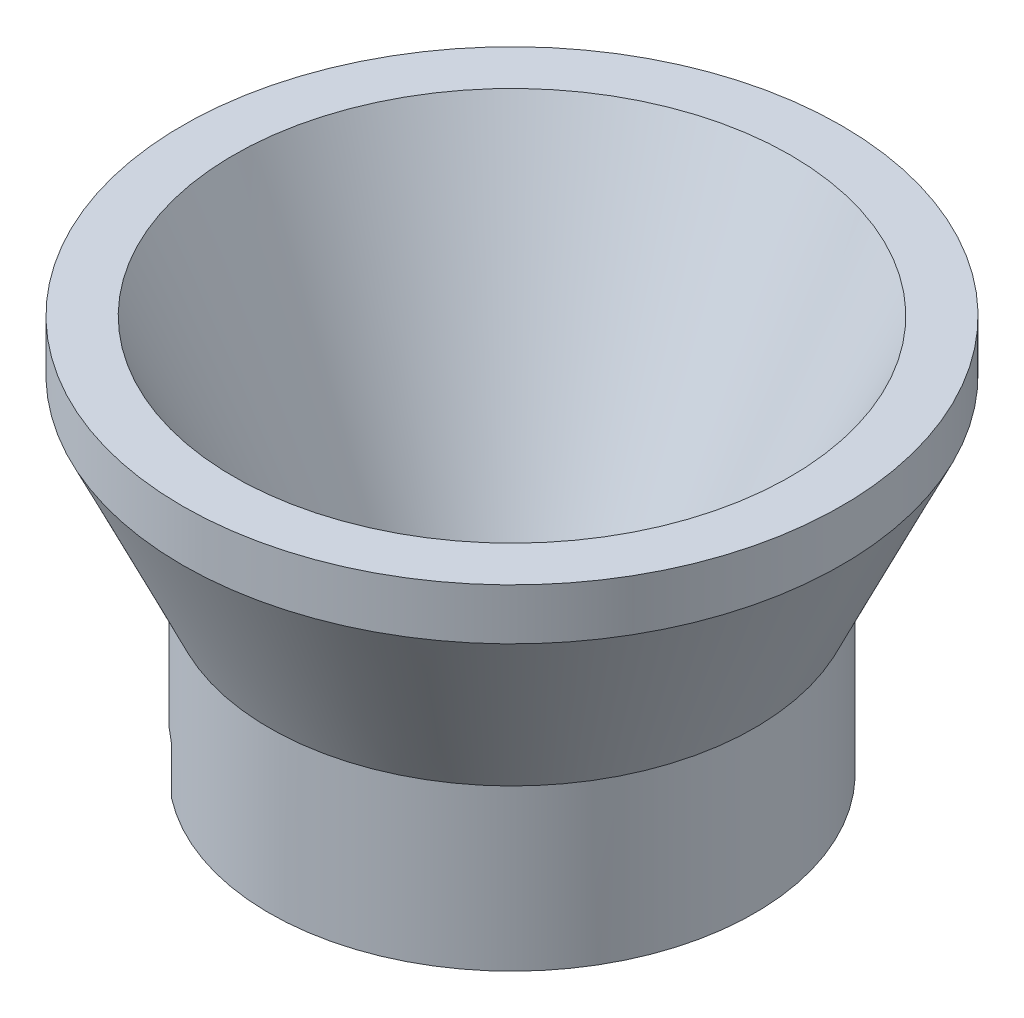
ISO-10303-21;
HEADER;
FILE_DESCRIPTION(('STEP AP214'),'2;1');
FILE_NAME('part.step','',(''),(''),'','','');
FILE_SCHEMA(('AUTOMOTIVE_DESIGN { 1 0 10303 214 1 1 1 1 }'));
ENDSEC;
DATA;
#1=APPLICATION_CONTEXT('core data for automotive mechanical design processes');
#2=APPLICATION_PROTOCOL_DEFINITION('international standard','automotive_design',2000,#1);
#3=PRODUCT_CONTEXT('',#1,'mechanical');
#4=PRODUCT('Part','Part','',(#3));
#5=PRODUCT_RELATED_PRODUCT_CATEGORY('part','',(#4));
#6=PRODUCT_DEFINITION_FORMATION('','',#4);
#7=PRODUCT_DEFINITION_CONTEXT('part definition',#1,'design');
#8=PRODUCT_DEFINITION('design','',#6,#7);
#9=PRODUCT_DEFINITION_SHAPE('','',#8);
#10=(LENGTH_UNIT() NAMED_UNIT(*) SI_UNIT(.MILLI.,.METRE.));
#11=(NAMED_UNIT(*) PLANE_ANGLE_UNIT() SI_UNIT($,.RADIAN.));
#12=(NAMED_UNIT(*) SI_UNIT($,.STERADIAN.) SOLID_ANGLE_UNIT());
#13=UNCERTAINTY_MEASURE_WITH_UNIT(LENGTH_MEASURE(1.E-05),#10,'distance_accuracy_value','');
#14=(GEOMETRIC_REPRESENTATION_CONTEXT(3) GLOBAL_UNCERTAINTY_ASSIGNED_CONTEXT((#13)) GLOBAL_UNIT_ASSIGNED_CONTEXT((#10,
#11,#12)) REPRESENTATION_CONTEXT('',''));
#15=CARTESIAN_POINT('',(0.,0.,0.));
#16=DIRECTION('',(0.,0.,1.));
#17=DIRECTION('',(1.,0.,0.));
#18=AXIS2_PLACEMENT_3D('',#15,#16,#17);
#19=CARTESIAN_POINT('',(0.,0.,0.));
#20=DIRECTION('',(0.,-1.,0.));
#21=DIRECTION('',(0.,0.,-1.));
#22=AXIS2_PLACEMENT_3D('',#19,#20,#21);
#23=CYLINDRICAL_SURFACE('',#22,7.5);
#24=DIRECTION('',(0.,1.,0.));
#25=VECTOR('',#24,1.);
#26=CARTESIAN_POINT('',(0.,0.,-7.5));
#27=LINE('',#26,#25);
#28=CARTESIAN_POINT('',(0.,0.,-7.5));
#29=VERTEX_POINT('',#28);
#30=CARTESIAN_POINT('',(0.,1.85000000000001,-7.5));
#31=VERTEX_POINT('',#30);
#32=EDGE_CURVE('E122',#29,#31,#27,.T.);
#33=ORIENTED_EDGE('',*,*,#32,.F.);
#34=CARTESIAN_POINT('',(0.,0.,0.));
#35=DIRECTION('',(0.,-1.,0.));
#36=DIRECTION('',(0.,0.,-1.));
#37=AXIS2_PLACEMENT_3D('',#34,#35,#36);
#38=CIRCLE('',#37,7.5);
#39=CARTESIAN_POINT('',(0.,0.,7.5));
#40=VERTEX_POINT('',#39);
#41=EDGE_CURVE('E11',#29,#40,#38,.T.);
#42=ORIENTED_EDGE('',*,*,#41,.T.);
#43=DIRECTION('',(0.,-1.,0.));
#44=VECTOR('',#43,1.);
#45=CARTESIAN_POINT('',(0.,0.,7.5));
#46=LINE('',#45,#44);
#47=CARTESIAN_POINT('',(0.,1.85000000000001,7.5));
#48=VERTEX_POINT('',#47);
#49=EDGE_CURVE('E89',#48,#40,#46,.T.);
#50=ORIENTED_EDGE('',*,*,#49,.F.);
#51=CARTESIAN_POINT('',(0.,1.85000000000001,0.));
#52=DIRECTION('',(0.,-1.,0.));
#53=DIRECTION('',(0.,0.,-1.));
#54=AXIS2_PLACEMENT_3D('',#51,#52,#53);
#55=CIRCLE('',#54,7.5);
#56=EDGE_CURVE('E41',#31,#48,#55,.T.);
#57=ORIENTED_EDGE('',*,*,#56,.F.);
#58=EDGE_LOOP('',(#33,#42,#50,#57));
#59=FACE_BOUND('',#58,.T.);
#60=ADVANCED_FACE('F33',(#59),#23,.F.);
#61=CARTESIAN_POINT('',(0.,0.,7.5));
#62=DIRECTION('',(0.,1.,0.));
#63=DIRECTION('',(0.,0.,1.));
#64=AXIS2_PLACEMENT_3D('',#61,#62,#63);
#65=PLANE('',#64);
#66=CARTESIAN_POINT('',(0.,0.,0.));
#67=DIRECTION('',(0.,-1.,0.));
#68=DIRECTION('',(0.,0.,-1.));
#69=AXIS2_PLACEMENT_3D('',#66,#67,#68);
#70=CIRCLE('',#69,9.5);
#71=CARTESIAN_POINT('',(-5.8309518948453,0.,-7.5));
#72=VERTEX_POINT('',#71);
#73=CARTESIAN_POINT('',(-5.8309518948453,0.,7.5));
#74=VERTEX_POINT('',#73);
#75=EDGE_CURVE('E88',#72,#74,#70,.T.);
#76=ORIENTED_EDGE('',*,*,#75,.T.);
#77=DIRECTION('',(1.,0.,0.));
#78=VECTOR('',#77,1.);
#79=CARTESIAN_POINT('',(-12.901,0.,7.5));
#80=LINE('',#79,#78);
#81=EDGE_CURVE('E56',#74,#40,#80,.T.);
#82=ORIENTED_EDGE('',*,*,#81,.T.);
#83=ORIENTED_EDGE('',*,*,#41,.F.);
#84=DIRECTION('',(1.,0.,0.));
#85=VECTOR('',#84,1.);
#86=CARTESIAN_POINT('',(-12.901,0.,-7.5));
#87=LINE('',#86,#85);
#88=EDGE_CURVE('E78',#72,#29,#87,.T.);
#89=ORIENTED_EDGE('',*,*,#88,.F.);
#90=EDGE_LOOP('',(#76,#82,#83,#89));
#91=FACE_BOUND('',#90,.T.);
#92=ADVANCED_FACE('F35',(#91),#65,.F.);
#93=CARTESIAN_POINT('',(0.,1.85000000000001,0.));
#94=DIRECTION('',(0.,-1.,0.));
#95=DIRECTION('',(0.,0.,-1.));
#96=AXIS2_PLACEMENT_3D('',#93,#94,#95);
#97=CONICAL_SURFACE('',#96,7.5,0.78539816339745);
#98=CARTESIAN_POINT('',(0.,3.5,0.));
#99=DIRECTION('',(0.,-1.,0.));
#100=DIRECTION('',(0.,0.,-1.));
#101=AXIS2_PLACEMENT_3D('',#98,#99,#100);
#102=CIRCLE('',#101,5.85);
#103=CARTESIAN_POINT('',(0.,3.5,-5.85));
#104=VERTEX_POINT('',#103);
#105=EDGE_CURVE('E114',#104,#104,#102,.T.);
#106=ORIENTED_EDGE('',*,*,#105,.F.);
#107=EDGE_LOOP('',(#106));
#108=FACE_BOUND('',#107,.T.);
#109=ORIENTED_EDGE('',*,*,#56,.T.);
#110=CARTESIAN_POINT('',(0.,1.85000000000001,0.));
#111=DIRECTION('',(0.,1.,0.));
#112=DIRECTION('',(0.,0.,1.));
#113=AXIS2_PLACEMENT_3D('',#110,#111,#112);
#114=CIRCLE('',#113,7.5);
#115=EDGE_CURVE('E83',#48,#31,#114,.F.);
#116=ORIENTED_EDGE('',*,*,#115,.T.);
#117=EDGE_LOOP('',(#109,#116));
#118=FACE_BOUND('',#117,.T.);
#119=ADVANCED_FACE('F119',(#108,#118),#97,.F.);
#120=CARTESIAN_POINT('',(0.,3.5,5.85));
#121=DIRECTION('',(0.,1.,0.));
#122=DIRECTION('',(0.,0.,1.));
#123=AXIS2_PLACEMENT_3D('',#120,#121,#122);
#124=PLANE('',#123);
#125=CARTESIAN_POINT('',(0.,3.5,0.));
#126=DIRECTION('',(0.,-1.,0.));
#127=DIRECTION('',(0.,0.,-1.));
#128=AXIS2_PLACEMENT_3D('',#125,#126,#127);
#129=CIRCLE('',#128,5.25);
#130=CARTESIAN_POINT('',(0.,3.5,-5.25));
#131=VERTEX_POINT('',#130);
#132=EDGE_CURVE('E111',#131,#131,#129,.T.);
#133=ORIENTED_EDGE('',*,*,#132,.F.);
#134=EDGE_LOOP('',(#133));
#135=FACE_BOUND('',#134,.T.);
#136=ORIENTED_EDGE('',*,*,#105,.T.);
#137=EDGE_LOOP('',(#136));
#138=FACE_BOUND('',#137,.T.);
#139=ADVANCED_FACE('F149',(#135,#138),#124,.F.);
#140=CARTESIAN_POINT('',(0.,3.5,0.));
#141=DIRECTION('',(0.,1.,0.));
#142=DIRECTION('',(0.,0.,1.));
#143=AXIS2_PLACEMENT_3D('',#140,#141,#142);
#144=CONICAL_SURFACE('',#143,5.25,0.440043224867618);
#145=CARTESIAN_POINT('',(0.,15.5,0.));
#146=DIRECTION('',(0.,-1.,0.));
#147=DIRECTION('',(0.,0.,-1.));
#148=AXIS2_PLACEMENT_3D('',#145,#146,#147);
#149=CIRCLE('',#148,10.9);
#150=CARTESIAN_POINT('',(0.,15.5,-10.9));
#151=VERTEX_POINT('',#150);
#152=EDGE_CURVE('E108',#151,#151,#149,.T.);
#153=ORIENTED_EDGE('',*,*,#152,.F.);
#154=EDGE_LOOP('',(#153));
#155=FACE_BOUND('',#154,.T.);
#156=ORIENTED_EDGE('',*,*,#132,.T.);
#157=EDGE_LOOP('',(#156));
#158=FACE_BOUND('',#157,.T.);
#159=ADVANCED_FACE('F153',(#155,#158),#144,.F.);
#160=CARTESIAN_POINT('',(0.,15.5,12.9));
#161=DIRECTION('',(0.,-1.,0.));
#162=DIRECTION('',(0.,0.,-1.));
#163=AXIS2_PLACEMENT_3D('',#160,#161,#162);
#164=PLANE('',#163);
#165=CARTESIAN_POINT('',(0.,15.5,0.));
#166=DIRECTION('',(0.,-1.,0.));
#167=DIRECTION('',(0.,0.,-1.));
#168=AXIS2_PLACEMENT_3D('',#165,#166,#167);
#169=CIRCLE('',#168,12.9);
#170=CARTESIAN_POINT('',(0.,15.5,-12.9));
#171=VERTEX_POINT('',#170);
#172=EDGE_CURVE('E105',#171,#171,#169,.T.);
#173=ORIENTED_EDGE('',*,*,#172,.F.);
#174=EDGE_LOOP('',(#173));
#175=FACE_BOUND('',#174,.T.);
#176=ORIENTED_EDGE('',*,*,#152,.T.);
#177=EDGE_LOOP('',(#176));
#178=FACE_BOUND('',#177,.T.);
#179=ADVANCED_FACE('F157',(#175,#178),#164,.F.);
#180=CARTESIAN_POINT('',(0.,0.,0.));
#181=DIRECTION('',(0.,-1.,0.));
#182=DIRECTION('',(0.,0.,-1.));
#183=AXIS2_PLACEMENT_3D('',#180,#181,#182);
#184=CYLINDRICAL_SURFACE('',#183,12.9);
#185=CARTESIAN_POINT('',(0.,13.5,0.));
#186=DIRECTION('',(0.,-1.,0.));
#187=DIRECTION('',(0.,0.,-1.));
#188=AXIS2_PLACEMENT_3D('',#185,#186,#187);
#189=CIRCLE('',#188,12.9);
#190=CARTESIAN_POINT('',(0.,13.5,-12.9));
#191=VERTEX_POINT('',#190);
#192=EDGE_CURVE('E97',#191,#191,#189,.T.);
#193=ORIENTED_EDGE('',*,*,#192,.F.);
#194=EDGE_LOOP('',(#193));
#195=FACE_BOUND('',#194,.T.);
#196=ORIENTED_EDGE('',*,*,#172,.T.);
#197=EDGE_LOOP('',(#196));
#198=FACE_BOUND('',#197,.T.);
#199=ADVANCED_FACE('F161',(#195,#198),#184,.T.);
#200=CARTESIAN_POINT('',(0.,13.5,0.));
#201=DIRECTION('',(0.,1.,0.));
#202=DIRECTION('',(0.,0.,1.));
#203=AXIS2_PLACEMENT_3D('',#200,#201,#202);
#204=CONICAL_SURFACE('',#203,12.9,0.440043224867618);
#205=CARTESIAN_POINT('',(0.,6.2787610619469,0.));
#206=DIRECTION('',(0.,-1.,0.));
#207=DIRECTION('',(0.,0.,-1.));
#208=AXIS2_PLACEMENT_3D('',#205,#206,#207);
#209=CIRCLE('',#208,9.5);
#210=CARTESIAN_POINT('',(0.,6.2787610619469,-9.5));
#211=VERTEX_POINT('',#210);
#212=EDGE_CURVE('E94',#211,#211,#209,.T.);
#213=ORIENTED_EDGE('',*,*,#212,.F.);
#214=EDGE_LOOP('',(#213));
#215=FACE_BOUND('',#214,.T.);
#216=ORIENTED_EDGE('',*,*,#192,.T.);
#217=EDGE_LOOP('',(#216));
#218=FACE_BOUND('',#217,.T.);
#219=ADVANCED_FACE('F165',(#215,#218),#204,.T.);
#220=CARTESIAN_POINT('',(0.,0.,0.));
#221=DIRECTION('',(0.,-1.,0.));
#222=DIRECTION('',(0.,0.,-1.));
#223=AXIS2_PLACEMENT_3D('',#220,#221,#222);
#224=CYLINDRICAL_SURFACE('',#223,9.5);
#225=CARTESIAN_POINT('',(0.,1.85000000000001,0.));
#226=DIRECTION('',(0.,1.,0.));
#227=DIRECTION('',(0.,0.,1.));
#228=AXIS2_PLACEMENT_3D('',#225,#226,#227);
#229=CIRCLE('',#228,9.5);
#230=CARTESIAN_POINT('',(-5.8309518948453,1.85000000000001,7.5));
#231=VERTEX_POINT('',#230);
#232=CARTESIAN_POINT('',(-5.8309518948453,1.85000000000001,-7.5));
#233=VERTEX_POINT('',#232);
#234=EDGE_CURVE('E48',#231,#233,#229,.F.);
#235=ORIENTED_EDGE('',*,*,#234,.F.);
#236=DIRECTION('',(0.,-1.,0.));
#237=VECTOR('',#236,1.);
#238=CARTESIAN_POINT('',(-5.8309518948453,0.,7.5));
#239=LINE('',#238,#237);
#240=EDGE_CURVE('E93',#74,#231,#239,.F.);
#241=ORIENTED_EDGE('',*,*,#240,.F.);
#242=ORIENTED_EDGE('',*,*,#75,.F.);
#243=DIRECTION('',(0.,-1.,0.));
#244=VECTOR('',#243,1.);
#245=CARTESIAN_POINT('',(-5.8309518948453,0.,-7.5));
#246=LINE('',#245,#244);
#247=EDGE_CURVE('E74',#233,#72,#246,.T.);
#248=ORIENTED_EDGE('',*,*,#247,.F.);
#249=EDGE_LOOP('',(#235,#241,#242,#248));
#250=FACE_BOUND('',#249,.T.);
#251=ORIENTED_EDGE('',*,*,#212,.T.);
#252=EDGE_LOOP('',(#251));
#253=FACE_BOUND('',#252,.T.);
#254=ADVANCED_FACE('F91',(#250,#253),#224,.T.);
#255=CARTESIAN_POINT('',(-12.901,1.85000000000001,7.5));
#256=DIRECTION('',(0.,1.,0.));
#257=DIRECTION('',(0.,0.,1.));
#258=AXIS2_PLACEMENT_3D('',#255,#256,#257);
#259=PLANE('',#258);
#260=DIRECTION('',(1.,0.,0.));
#261=VECTOR('',#260,1.);
#262=CARTESIAN_POINT('',(-12.901,1.85000000000001,7.5));
#263=LINE('',#262,#261);
#264=EDGE_CURVE('E129',#231,#48,#263,.T.);
#265=ORIENTED_EDGE('',*,*,#264,.F.);
#266=ORIENTED_EDGE('',*,*,#234,.T.);
#267=DIRECTION('',(1.,0.,0.));
#268=VECTOR('',#267,1.);
#269=CARTESIAN_POINT('',(-12.901,1.85000000000001,-7.5));
#270=LINE('',#269,#268);
#271=EDGE_CURVE('E80',#233,#31,#270,.T.);
#272=ORIENTED_EDGE('',*,*,#271,.T.);
#273=ORIENTED_EDGE('',*,*,#115,.F.);
#274=EDGE_LOOP('',(#265,#266,#272,#273));
#275=FACE_BOUND('',#274,.T.);
#276=ADVANCED_FACE('F131',(#275),#259,.F.);
#277=CARTESIAN_POINT('',(-12.901,0.,7.5));
#278=DIRECTION('',(0.,0.,1.));
#279=DIRECTION('',(1.,0.,0.));
#280=AXIS2_PLACEMENT_3D('',#277,#278,#279);
#281=PLANE('',#280);
#282=ORIENTED_EDGE('',*,*,#240,.T.);
#283=ORIENTED_EDGE('',*,*,#264,.T.);
#284=ORIENTED_EDGE('',*,*,#49,.T.);
#285=ORIENTED_EDGE('',*,*,#81,.F.);
#286=EDGE_LOOP('',(#282,#283,#284,#285));
#287=FACE_BOUND('',#286,.T.);
#288=ADVANCED_FACE('F132',(#287),#281,.F.);
#289=CARTESIAN_POINT('',(-12.901,0.,-7.5));
#290=DIRECTION('',(0.,0.,-1.));
#291=DIRECTION('',(-1.,0.,0.));
#292=AXIS2_PLACEMENT_3D('',#289,#290,#291);
#293=PLANE('',#292);
#294=ORIENTED_EDGE('',*,*,#247,.T.);
#295=ORIENTED_EDGE('',*,*,#88,.T.);
#296=ORIENTED_EDGE('',*,*,#32,.T.);
#297=ORIENTED_EDGE('',*,*,#271,.F.);
#298=EDGE_LOOP('',(#294,#295,#296,#297));
#299=FACE_BOUND('',#298,.T.);
#300=ADVANCED_FACE('F76',(#299),#293,.F.);
#301=CLOSED_SHELL('',(#60,#92,#119,#139,#159,#179,#199,#219,#254,#276,#288,#300));
#302=MANIFOLD_SOLID_BREP('B2',#301);
#303=ADVANCED_BREP_SHAPE_REPRESENTATION('',(#18,#302),#14);
#304=SHAPE_DEFINITION_REPRESENTATION(#9,#303);
ENDSEC;
END-ISO-10303-21;
